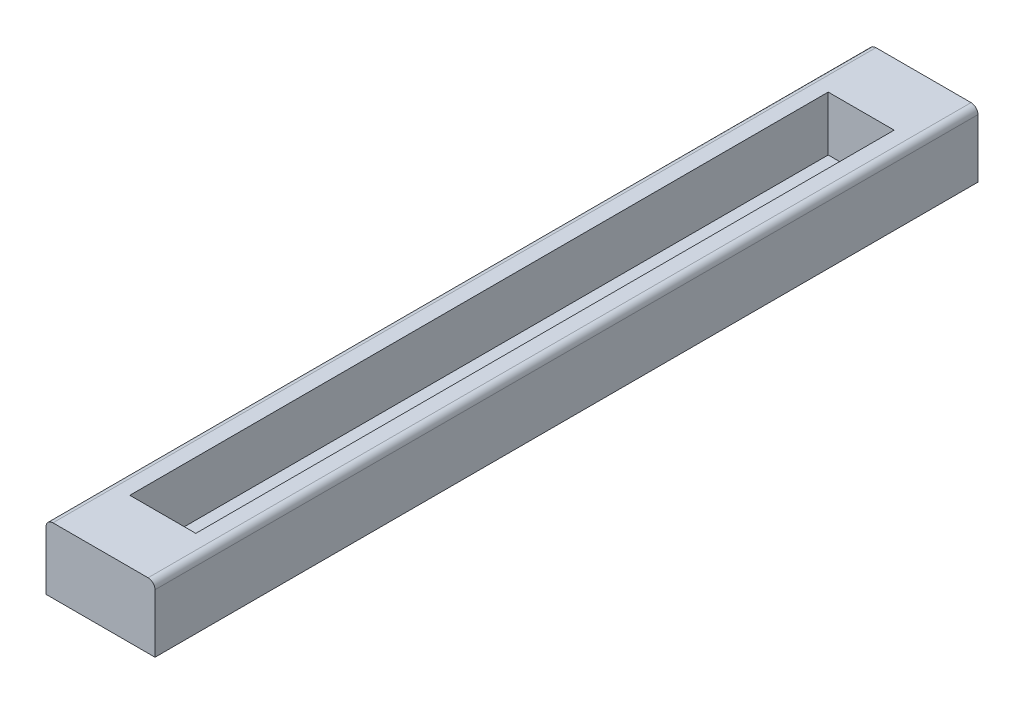
ISO-10303-21;
HEADER;
FILE_DESCRIPTION(('STEP AP214'),'2;1');
FILE_NAME('part.step','',(''),(''),'','','');
FILE_SCHEMA(('AUTOMOTIVE_DESIGN { 1 0 10303 214 1 1 1 1 }'));
ENDSEC;
DATA;
#1=APPLICATION_CONTEXT('core data for automotive mechanical design processes');
#2=APPLICATION_PROTOCOL_DEFINITION('international standard','automotive_design',2000,#1);
#3=PRODUCT_CONTEXT('',#1,'mechanical');
#4=PRODUCT('Part','Part','',(#3));
#5=PRODUCT_RELATED_PRODUCT_CATEGORY('part','',(#4));
#6=PRODUCT_DEFINITION_FORMATION('','',#4);
#7=PRODUCT_DEFINITION_CONTEXT('part definition',#1,'design');
#8=PRODUCT_DEFINITION('design','',#6,#7);
#9=PRODUCT_DEFINITION_SHAPE('','',#8);
#10=(LENGTH_UNIT() NAMED_UNIT(*) SI_UNIT(.MILLI.,.METRE.));
#11=(NAMED_UNIT(*) PLANE_ANGLE_UNIT() SI_UNIT($,.RADIAN.));
#12=(NAMED_UNIT(*) SI_UNIT($,.STERADIAN.) SOLID_ANGLE_UNIT());
#13=UNCERTAINTY_MEASURE_WITH_UNIT(LENGTH_MEASURE(1.E-05),#10,'distance_accuracy_value','');
#14=(GEOMETRIC_REPRESENTATION_CONTEXT(3) GLOBAL_UNCERTAINTY_ASSIGNED_CONTEXT((#13)) GLOBAL_UNIT_ASSIGNED_CONTEXT((#10,
#11,#12)) REPRESENTATION_CONTEXT('',''));
#15=CARTESIAN_POINT('',(0.,0.,0.));
#16=DIRECTION('',(0.,0.,1.));
#17=DIRECTION('',(1.,0.,0.));
#18=AXIS2_PLACEMENT_3D('',#15,#16,#17);
#19=CARTESIAN_POINT('',(-1.0000000066,0.,-7.5499999876));
#20=DIRECTION('',(1.,0.,0.));
#21=DIRECTION('',(0.,1.,0.));
#22=AXIS2_PLACEMENT_3D('',#19,#20,#21);
#23=PLANE('',#22);
#24=DIRECTION('',(0.,0.,1.));
#25=VECTOR('',#24,1.);
#26=CARTESIAN_POINT('',(-1.0000000066,0.,0.));
#27=LINE('',#26,#25);
#28=CARTESIAN_POINT('',(-1.0000000066,0.,-7.5499999876));
#29=VERTEX_POINT('',#28);
#30=CARTESIAN_POINT('',(-1.0000000066,0.,7.5499999876));
#31=VERTEX_POINT('',#30);
#32=EDGE_CURVE('E138',#29,#31,#27,.T.);
#33=ORIENTED_EDGE('',*,*,#32,.T.);
#34=DIRECTION('',(0.,-1.,0.));
#35=VECTOR('',#34,1.);
#36=CARTESIAN_POINT('',(-1.0000000066,0.5999999938,7.5499999876));
#37=LINE('',#36,#35);
#38=CARTESIAN_POINT('',(-1.0000000066,1.0729999876,7.5499999876));
#39=VERTEX_POINT('',#38);
#40=EDGE_CURVE('E125',#39,#31,#37,.T.);
#41=ORIENTED_EDGE('',*,*,#40,.F.);
#42=DIRECTION('',(0.,0.,1.));
#43=VECTOR('',#42,1.);
#44=CARTESIAN_POINT('',(-1.0000000066,1.0729999876,0.));
#45=LINE('',#44,#43);
#46=CARTESIAN_POINT('',(-1.0000000066,1.0729999876,-7.5499999876));
#47=VERTEX_POINT('',#46);
#48=EDGE_CURVE('E96',#39,#47,#45,.F.);
#49=ORIENTED_EDGE('',*,*,#48,.T.);
#50=DIRECTION('',(0.,1.,0.));
#51=VECTOR('',#50,1.);
#52=CARTESIAN_POINT('',(-1.0000000066,0.5364999938,-7.5499999876));
#53=LINE('',#52,#51);
#54=EDGE_CURVE('E148',#29,#47,#53,.T.);
#55=ORIENTED_EDGE('',*,*,#54,.F.);
#56=EDGE_LOOP('',(#33,#41,#49,#55));
#57=FACE_BOUND('',#56,.T.);
#58=ADVANCED_FACE('F16',(#57),#23,.F.);
#59=CARTESIAN_POINT('',(1.0000000066,0.,-7.5499999876));
#60=DIRECTION('',(0.,1.,0.));
#61=DIRECTION('',(-1.,0.,0.));
#62=AXIS2_PLACEMENT_3D('',#59,#60,#61);
#63=PLANE('',#62);
#64=DIRECTION('',(0.,0.,1.));
#65=VECTOR('',#64,1.);
#66=CARTESIAN_POINT('',(1.0000000066,0.,0.));
#67=LINE('',#66,#65);
#68=CARTESIAN_POINT('',(1.0000000066,0.,-7.5499999876));
#69=VERTEX_POINT('',#68);
#70=CARTESIAN_POINT('',(1.0000000066,0.,7.5499999876));
#71=VERTEX_POINT('',#70);
#72=EDGE_CURVE('E127',#69,#71,#67,.T.);
#73=ORIENTED_EDGE('',*,*,#72,.T.);
#74=DIRECTION('',(1.,0.,0.));
#75=VECTOR('',#74,1.);
#76=CARTESIAN_POINT('',(0.,0.,7.5499999876));
#77=LINE('',#76,#75);
#78=EDGE_CURVE('E122',#31,#71,#77,.T.);
#79=ORIENTED_EDGE('',*,*,#78,.F.);
#80=ORIENTED_EDGE('',*,*,#32,.F.);
#81=DIRECTION('',(1.,0.,0.));
#82=VECTOR('',#81,1.);
#83=CARTESIAN_POINT('',(0.,0.,-7.5499999876));
#84=LINE('',#83,#82);
#85=EDGE_CURVE('E135',#29,#69,#84,.T.);
#86=ORIENTED_EDGE('',*,*,#85,.T.);
#87=EDGE_LOOP('',(#73,#79,#80,#86));
#88=FACE_BOUND('',#87,.T.);
#89=ADVANCED_FACE('F229',(#88),#63,.F.);
#90=CARTESIAN_POINT('',(1.0000000066,1.0729999876,-7.5499999876));
#91=DIRECTION('',(-1.,0.,0.));
#92=DIRECTION('',(0.,-1.,0.));
#93=AXIS2_PLACEMENT_3D('',#90,#91,#92);
#94=PLANE('',#93);
#95=DIRECTION('',(0.,0.,-1.));
#96=VECTOR('',#95,1.);
#97=CARTESIAN_POINT('',(1.0000000066,1.0729999875479,0.));
#98=LINE('',#97,#96);
#99=CARTESIAN_POINT('',(1.0000000066,1.07299998757395,-7.5499999876));
#100=VERTEX_POINT('',#99);
#101=CARTESIAN_POINT('',(1.0000000066,1.07299998757395,7.5499999876));
#102=VERTEX_POINT('',#101);
#103=EDGE_CURVE('E130',#100,#102,#98,.F.);
#104=ORIENTED_EDGE('',*,*,#103,.T.);
#105=DIRECTION('',(0.,1.,0.));
#106=VECTOR('',#105,1.);
#107=CARTESIAN_POINT('',(1.0000000066,0.5999999938,7.5499999876));
#108=LINE('',#107,#106);
#109=EDGE_CURVE('E99',#71,#102,#108,.T.);
#110=ORIENTED_EDGE('',*,*,#109,.F.);
#111=ORIENTED_EDGE('',*,*,#72,.F.);
#112=DIRECTION('',(0.,1.,0.));
#113=VECTOR('',#112,1.);
#114=CARTESIAN_POINT('',(1.0000000066,0.5999999938,-7.5499999876));
#115=LINE('',#114,#113);
#116=EDGE_CURVE('E143',#69,#100,#115,.T.);
#117=ORIENTED_EDGE('',*,*,#116,.T.);
#118=EDGE_LOOP('',(#104,#110,#111,#117));
#119=FACE_BOUND('',#118,.T.);
#120=ADVANCED_FACE('F226',(#119),#94,.F.);
#121=CARTESIAN_POINT('',(-1.0000000066,0.,7.5499999876));
#122=DIRECTION('',(0.,0.,1.));
#123=DIRECTION('',(1.,0.,0.));
#124=AXIS2_PLACEMENT_3D('',#121,#122,#123);
#125=PLANE('',#124);
#126=DIRECTION('',(-1.,0.,0.));
#127=VECTOR('',#126,1.);
#128=CARTESIAN_POINT('',(0.,1.1999999876,7.5499999876));
#129=LINE('',#128,#127);
#130=CARTESIAN_POINT('',(0.8730000066,1.1999999876,7.5499999876));
#131=VERTEX_POINT('',#130);
#132=CARTESIAN_POINT('',(-0.8730000066,1.1999999876,7.5499999876));
#133=VERTEX_POINT('',#132);
#134=EDGE_CURVE('E104',#131,#133,#129,.T.);
#135=ORIENTED_EDGE('',*,*,#134,.T.);
#136=CARTESIAN_POINT('',(-0.8730000066,1.0729999876,7.5499999876));
#137=DIRECTION('',(0.,0.,-1.));
#138=DIRECTION('',(-1.,0.,0.));
#139=AXIS2_PLACEMENT_3D('',#136,#137,#138);
#140=CIRCLE('',#139,0.127);
#141=EDGE_CURVE('E20',#133,#39,#140,.F.);
#142=ORIENTED_EDGE('',*,*,#141,.T.);
#143=ORIENTED_EDGE('',*,*,#40,.T.);
#144=ORIENTED_EDGE('',*,*,#78,.T.);
#145=ORIENTED_EDGE('',*,*,#109,.T.);
#146=CARTESIAN_POINT('',(0.8730000066,1.0729999876,7.5499999876));
#147=DIRECTION('',(0.,0.,-1.));
#148=DIRECTION('',(-1.,0.,0.));
#149=AXIS2_PLACEMENT_3D('',#146,#147,#148);
#150=CIRCLE('',#149,0.127);
#151=EDGE_CURVE('E111',#102,#131,#150,.F.);
#152=ORIENTED_EDGE('',*,*,#151,.T.);
#153=EDGE_LOOP('',(#135,#142,#143,#144,#145,#152));
#154=FACE_BOUND('',#153,.T.);
#155=ADVANCED_FACE('F109',(#154),#125,.T.);
#156=CARTESIAN_POINT('',(-0.8730000066,1.0729999876,7.5499999876));
#157=DIRECTION('',(0.,0.,-1.));
#158=DIRECTION('',(-1.,0.,0.));
#159=AXIS2_PLACEMENT_3D('',#156,#157,#158);
#160=CYLINDRICAL_SURFACE('',#159,0.127);
#161=ORIENTED_EDGE('',*,*,#48,.F.);
#162=ORIENTED_EDGE('',*,*,#141,.F.);
#163=DIRECTION('',(0.,0.,-1.));
#164=VECTOR('',#163,1.);
#165=CARTESIAN_POINT('',(-0.8730000066,1.1999999876,0.));
#166=LINE('',#165,#164);
#167=CARTESIAN_POINT('',(-0.8730000066,1.1999999876,-7.5499999876));
#168=VERTEX_POINT('',#167);
#169=EDGE_CURVE('E94',#133,#168,#166,.T.);
#170=ORIENTED_EDGE('',*,*,#169,.T.);
#171=CARTESIAN_POINT('',(-0.8730000066,1.0729999876,-7.5499999876));
#172=DIRECTION('',(0.,0.,-1.));
#173=DIRECTION('',(-1.,0.,0.));
#174=AXIS2_PLACEMENT_3D('',#171,#172,#173);
#175=CIRCLE('',#174,0.127);
#176=EDGE_CURVE('E133',#168,#47,#175,.F.);
#177=ORIENTED_EDGE('',*,*,#176,.T.);
#178=EDGE_LOOP('',(#161,#162,#170,#177));
#179=FACE_BOUND('',#178,.T.);
#180=ADVANCED_FACE('F92',(#179),#160,.T.);
#181=CARTESIAN_POINT('',(-1.0000000066,0.,-7.5499999876));
#182=DIRECTION('',(0.,0.,1.));
#183=DIRECTION('',(1.,0.,0.));
#184=AXIS2_PLACEMENT_3D('',#181,#182,#183);
#185=PLANE('',#184);
#186=ORIENTED_EDGE('',*,*,#176,.F.);
#187=DIRECTION('',(1.,0.,0.));
#188=VECTOR('',#187,1.);
#189=CARTESIAN_POINT('',(0.,1.1999999876,-7.5499999876));
#190=LINE('',#189,#188);
#191=CARTESIAN_POINT('',(0.8730000066,1.1999999876,-7.5499999876));
#192=VERTEX_POINT('',#191);
#193=EDGE_CURVE('E107',#168,#192,#190,.T.);
#194=ORIENTED_EDGE('',*,*,#193,.T.);
#195=CARTESIAN_POINT('',(0.8730000066,1.0729999876,-7.5499999876));
#196=DIRECTION('',(0.,0.,-1.));
#197=DIRECTION('',(-1.,0.,0.));
#198=AXIS2_PLACEMENT_3D('',#195,#196,#197);
#199=CIRCLE('',#198,0.127);
#200=EDGE_CURVE('E115',#192,#100,#199,.T.);
#201=ORIENTED_EDGE('',*,*,#200,.T.);
#202=ORIENTED_EDGE('',*,*,#116,.F.);
#203=ORIENTED_EDGE('',*,*,#85,.F.);
#204=ORIENTED_EDGE('',*,*,#54,.T.);
#205=EDGE_LOOP('',(#186,#194,#201,#202,#203,#204));
#206=FACE_BOUND('',#205,.T.);
#207=ADVANCED_FACE('F221',(#206),#185,.F.);
#208=CARTESIAN_POINT('',(0.8730000066,1.0729999876,7.5499999876));
#209=DIRECTION('',(0.,0.,-1.));
#210=DIRECTION('',(-1.,0.,0.));
#211=AXIS2_PLACEMENT_3D('',#208,#209,#210);
#212=CYLINDRICAL_SURFACE('',#211,0.127);
#213=DIRECTION('',(0.,0.,1.));
#214=VECTOR('',#213,1.);
#215=CARTESIAN_POINT('',(0.8730000066,1.1999999876,0.));
#216=LINE('',#215,#214);
#217=EDGE_CURVE('E119',#192,#131,#216,.T.);
#218=ORIENTED_EDGE('',*,*,#217,.T.);
#219=ORIENTED_EDGE('',*,*,#151,.F.);
#220=ORIENTED_EDGE('',*,*,#103,.F.);
#221=ORIENTED_EDGE('',*,*,#200,.F.);
#222=EDGE_LOOP('',(#218,#219,#220,#221));
#223=FACE_BOUND('',#222,.T.);
#224=ADVANCED_FACE('F220',(#223),#212,.T.);
#225=CARTESIAN_POINT('',(-0.6050000092,0.2000000064,-6.4069999876));
#226=DIRECTION('',(-1.,0.,0.));
#227=DIRECTION('',(0.,0.,1.));
#228=AXIS2_PLACEMENT_3D('',#225,#226,#227);
#229=PLANE('',#228);
#230=DIRECTION('',(0.,0.,1.));
#231=VECTOR('',#230,1.);
#232=CARTESIAN_POINT('',(-0.605000004373883,1.1999999876,0.));
#233=LINE('',#232,#231);
#234=CARTESIAN_POINT('',(-0.605000007993471,1.1999999876,-6.40699998896931));
#235=VERTEX_POINT('',#234);
#236=CARTESIAN_POINT('',(-0.605000007993471,1.1999999876,6.40699998896931));
#237=VERTEX_POINT('',#236);
#238=EDGE_CURVE('E167',#235,#237,#233,.T.);
#239=ORIENTED_EDGE('',*,*,#238,.T.);
#240=DIRECTION('',(0.,-1.,0.));
#241=VECTOR('',#240,1.);
#242=CARTESIAN_POINT('',(-0.6050000092,0.699999997,6.4069999876));
#243=LINE('',#242,#241);
#244=CARTESIAN_POINT('',(-0.6050000092,0.2000000064,6.4069999876));
#245=VERTEX_POINT('',#244);
#246=EDGE_CURVE('E170',#237,#245,#243,.T.);
#247=ORIENTED_EDGE('',*,*,#246,.T.);
#248=DIRECTION('',(0.,0.,-1.));
#249=VECTOR('',#248,1.);
#250=CARTESIAN_POINT('',(-0.6050000092,0.2000000064,0.));
#251=LINE('',#250,#249);
#252=CARTESIAN_POINT('',(-0.6050000092,0.2000000064,-6.4069999876));
#253=VERTEX_POINT('',#252);
#254=EDGE_CURVE('E181',#245,#253,#251,.T.);
#255=ORIENTED_EDGE('',*,*,#254,.T.);
#256=DIRECTION('',(0.,-1.,0.));
#257=VECTOR('',#256,1.);
#258=CARTESIAN_POINT('',(-0.6050000092,0.699999997,-6.4069999876));
#259=LINE('',#258,#257);
#260=EDGE_CURVE('E113',#235,#253,#259,.T.);
#261=ORIENTED_EDGE('',*,*,#260,.F.);
#262=EDGE_LOOP('',(#239,#247,#255,#261));
#263=FACE_BOUND('',#262,.T.);
#264=ADVANCED_FACE('F217',(#263),#229,.F.);
#265=CARTESIAN_POINT('',(-0.8730000066,1.1999999876,-7.5499999876));
#266=DIRECTION('',(0.,-1.,0.));
#267=DIRECTION('',(1.,0.,0.));
#268=AXIS2_PLACEMENT_3D('',#265,#266,#267);
#269=PLANE('',#268);
#270=DIRECTION('',(0.,0.,1.));
#271=VECTOR('',#270,1.);
#272=CARTESIAN_POINT('',(0.6050000092,1.1999999876,0.));
#273=LINE('',#272,#271);
#274=CARTESIAN_POINT('',(0.605000006786942,1.1999999876,-6.40699999033862));
#275=VERTEX_POINT('',#274);
#276=CARTESIAN_POINT('',(0.605000006786942,1.1999999876,6.40699999033862));
#277=VERTEX_POINT('',#276);
#278=EDGE_CURVE('E188',#275,#277,#273,.T.);
#279=ORIENTED_EDGE('',*,*,#278,.T.);
#280=DIRECTION('',(-1.,0.,0.));
#281=VECTOR('',#280,1.);
#282=CARTESIAN_POINT('',(0.,1.1999999876,6.4069999876));
#283=LINE('',#282,#281);
#284=EDGE_CURVE('E174',#277,#237,#283,.T.);
#285=ORIENTED_EDGE('',*,*,#284,.T.);
#286=ORIENTED_EDGE('',*,*,#238,.F.);
#287=DIRECTION('',(1.,0.,0.));
#288=VECTOR('',#287,1.);
#289=CARTESIAN_POINT('',(0.,1.1999999876,-6.4069999876));
#290=LINE('',#289,#288);
#291=EDGE_CURVE('E184',#235,#275,#290,.T.);
#292=ORIENTED_EDGE('',*,*,#291,.T.);
#293=EDGE_LOOP('',(#279,#285,#286,#292));
#294=FACE_BOUND('',#293,.T.);
#295=ORIENTED_EDGE('',*,*,#193,.F.);
#296=ORIENTED_EDGE('',*,*,#169,.F.);
#297=ORIENTED_EDGE('',*,*,#134,.F.);
#298=ORIENTED_EDGE('',*,*,#217,.F.);
#299=EDGE_LOOP('',(#295,#296,#297,#298));
#300=FACE_BOUND('',#299,.T.);
#301=ADVANCED_FACE('F102',(#294,#300),#269,.F.);
#302=CARTESIAN_POINT('',(-0.6050000092,0.2000000064,6.4069999876));
#303=DIRECTION('',(0.,0.,1.));
#304=DIRECTION('',(1.,0.,0.));
#305=AXIS2_PLACEMENT_3D('',#302,#303,#304);
#306=PLANE('',#305);
#307=DIRECTION('',(0.,-1.,0.));
#308=VECTOR('',#307,1.);
#309=CARTESIAN_POINT('',(0.6050000092,0.699999997,6.4069999876));
#310=LINE('',#309,#308);
#311=CARTESIAN_POINT('',(0.6050000092,0.2000000064,6.4069999876));
#312=VERTEX_POINT('',#311);
#313=EDGE_CURVE('E191',#277,#312,#310,.T.);
#314=ORIENTED_EDGE('',*,*,#313,.T.);
#315=DIRECTION('',(-1.,0.,0.));
#316=VECTOR('',#315,1.);
#317=CARTESIAN_POINT('',(0.,0.2000000064,6.4069999876));
#318=LINE('',#317,#316);
#319=EDGE_CURVE('E178',#312,#245,#318,.T.);
#320=ORIENTED_EDGE('',*,*,#319,.T.);
#321=ORIENTED_EDGE('',*,*,#246,.F.);
#322=ORIENTED_EDGE('',*,*,#284,.F.);
#323=EDGE_LOOP('',(#314,#320,#321,#322));
#324=FACE_BOUND('',#323,.T.);
#325=ADVANCED_FACE('F202',(#324),#306,.F.);
#326=CARTESIAN_POINT('',(-0.6050000092,0.2000000064,6.4069999876));
#327=DIRECTION('',(0.,-1.,0.));
#328=DIRECTION('',(0.,0.,-1.));
#329=AXIS2_PLACEMENT_3D('',#326,#327,#328);
#330=PLANE('',#329);
#331=ORIENTED_EDGE('',*,*,#254,.F.);
#332=ORIENTED_EDGE('',*,*,#319,.F.);
#333=DIRECTION('',(0.,0.,-1.));
#334=VECTOR('',#333,1.);
#335=CARTESIAN_POINT('',(0.6050000092,0.2000000064,0.));
#336=LINE('',#335,#334);
#337=CARTESIAN_POINT('',(0.6050000092,0.2000000064,-6.4069999876));
#338=VERTEX_POINT('',#337);
#339=EDGE_CURVE('E26',#312,#338,#336,.T.);
#340=ORIENTED_EDGE('',*,*,#339,.T.);
#341=DIRECTION('',(-1.,0.,0.));
#342=VECTOR('',#341,1.);
#343=CARTESIAN_POINT('',(0.,0.2000000064,-6.4069999876));
#344=LINE('',#343,#342);
#345=EDGE_CURVE('E34',#338,#253,#344,.T.);
#346=ORIENTED_EDGE('',*,*,#345,.T.);
#347=EDGE_LOOP('',(#331,#332,#340,#346));
#348=FACE_BOUND('',#347,.T.);
#349=ADVANCED_FACE('F198',(#348),#330,.F.);
#350=CARTESIAN_POINT('',(-0.6050000092,1.1999999876,-6.4069999876));
#351=DIRECTION('',(0.,0.,-1.));
#352=DIRECTION('',(1.,0.,0.));
#353=AXIS2_PLACEMENT_3D('',#350,#351,#352);
#354=PLANE('',#353);
#355=DIRECTION('',(0.,1.,0.));
#356=VECTOR('',#355,1.);
#357=CARTESIAN_POINT('',(0.6050000092,0.699999997,-6.4069999876));
#358=LINE('',#357,#356);
#359=EDGE_CURVE('E11',#338,#275,#358,.T.);
#360=ORIENTED_EDGE('',*,*,#359,.T.);
#361=ORIENTED_EDGE('',*,*,#291,.F.);
#362=ORIENTED_EDGE('',*,*,#260,.T.);
#363=ORIENTED_EDGE('',*,*,#345,.F.);
#364=EDGE_LOOP('',(#360,#361,#362,#363));
#365=FACE_BOUND('',#364,.T.);
#366=ADVANCED_FACE('F205',(#365),#354,.F.);
#367=CARTESIAN_POINT('',(0.6050000092,0.2000000064,6.4069999876));
#368=DIRECTION('',(1.,0.,0.));
#369=DIRECTION('',(0.,0.,-1.));
#370=AXIS2_PLACEMENT_3D('',#367,#368,#369);
#371=PLANE('',#370);
#372=ORIENTED_EDGE('',*,*,#339,.F.);
#373=ORIENTED_EDGE('',*,*,#313,.F.);
#374=ORIENTED_EDGE('',*,*,#278,.F.);
#375=ORIENTED_EDGE('',*,*,#359,.F.);
#376=EDGE_LOOP('',(#372,#373,#374,#375));
#377=FACE_BOUND('',#376,.T.);
#378=ADVANCED_FACE('F18',(#377),#371,.F.);
#379=CLOSED_SHELL('',(#58,#89,#120,#155,#180,#207,#224,#264,#301,#325,#349,#366,#378));
#380=MANIFOLD_SOLID_BREP('B1',#379);
#381=ADVANCED_BREP_SHAPE_REPRESENTATION('',(#18,#380),#14);
#382=SHAPE_DEFINITION_REPRESENTATION(#9,#381);
ENDSEC;
END-ISO-10303-21;
